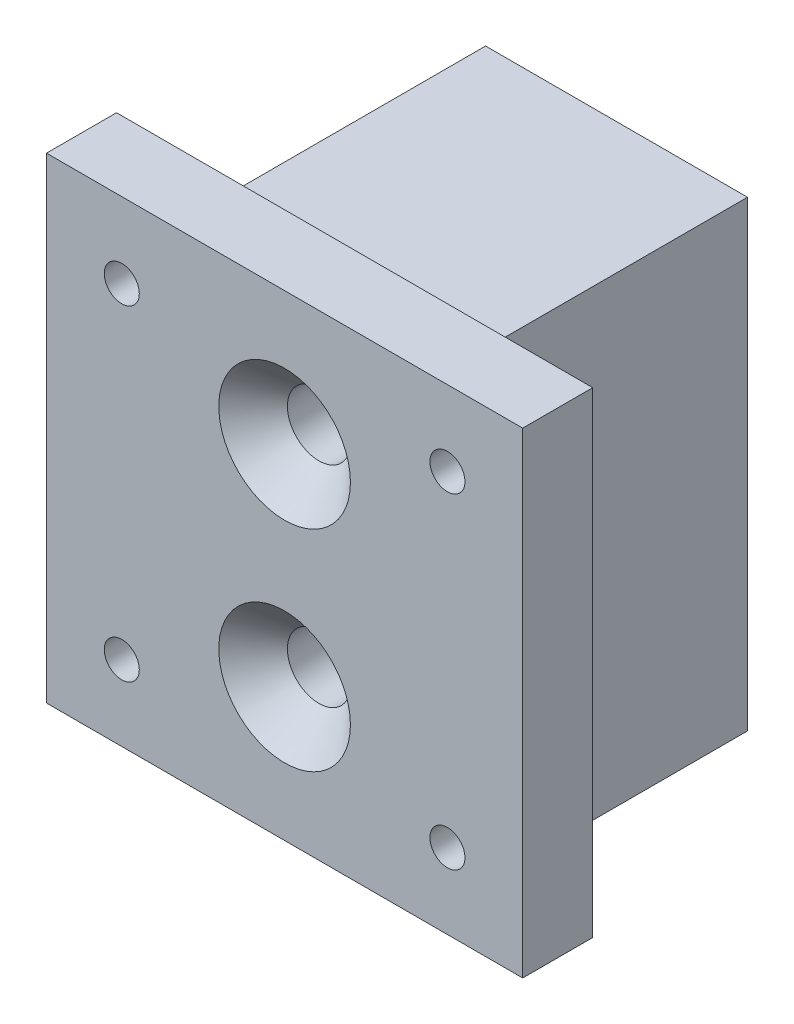
ISO-10303-21;
HEADER;
FILE_DESCRIPTION(('STEP AP214'),'2;1');
FILE_NAME('part.step','',(''),(''),'','','');
FILE_SCHEMA(('AUTOMOTIVE_DESIGN { 1 0 10303 214 1 1 1 1 }'));
ENDSEC;
DATA;
#1=APPLICATION_CONTEXT('core data for automotive mechanical design processes');
#2=APPLICATION_PROTOCOL_DEFINITION('international standard','automotive_design',2000,#1);
#3=PRODUCT_CONTEXT('',#1,'mechanical');
#4=PRODUCT('Part','Part','',(#3));
#5=PRODUCT_RELATED_PRODUCT_CATEGORY('part','',(#4));
#6=PRODUCT_DEFINITION_FORMATION('','',#4);
#7=PRODUCT_DEFINITION_CONTEXT('part definition',#1,'design');
#8=PRODUCT_DEFINITION('design','',#6,#7);
#9=PRODUCT_DEFINITION_SHAPE('','',#8);
#10=(LENGTH_UNIT() NAMED_UNIT(*) SI_UNIT(.MILLI.,.METRE.));
#11=(NAMED_UNIT(*) PLANE_ANGLE_UNIT() SI_UNIT($,.RADIAN.));
#12=(NAMED_UNIT(*) SI_UNIT($,.STERADIAN.) SOLID_ANGLE_UNIT());
#13=UNCERTAINTY_MEASURE_WITH_UNIT(LENGTH_MEASURE(1.E-05),#10,'distance_accuracy_value','');
#14=(GEOMETRIC_REPRESENTATION_CONTEXT(3) GLOBAL_UNCERTAINTY_ASSIGNED_CONTEXT((#13)) GLOBAL_UNIT_ASSIGNED_CONTEXT((#10,
#11,#12)) REPRESENTATION_CONTEXT('',''));
#15=CARTESIAN_POINT('',(0.,0.,0.));
#16=DIRECTION('',(0.,0.,1.));
#17=DIRECTION('',(1.,0.,0.));
#18=AXIS2_PLACEMENT_3D('',#15,#16,#17);
#19=CARTESIAN_POINT('',(18.7,30.,0.));
#20=DIRECTION('',(0.,0.,-1.));
#21=DIRECTION('',(-1.,0.,0.));
#22=AXIS2_PLACEMENT_3D('',#19,#20,#21);
#23=PLANE('',#22);
#24=DIRECTION('',(1.,0.,0.));
#25=VECTOR('',#24,1.);
#26=CARTESIAN_POINT('',(-7.65,0.400000000000005,0.));
#27=LINE('',#26,#25);
#28=CARTESIAN_POINT('',(0.,0.400000000000005,0.));
#29=VERTEX_POINT('',#28);
#30=CARTESIAN_POINT('',(18.7,0.400000000000005,0.));
#31=VERTEX_POINT('',#30);
#32=EDGE_CURVE('E11',#29,#31,#27,.T.);
#33=ORIENTED_EDGE('',*,*,#32,.F.);
#34=DIRECTION('',(0.,-1.,0.));
#35=VECTOR('',#34,1.);
#36=CARTESIAN_POINT('',(0.,30.,0.));
#37=LINE('',#36,#35);
#38=CARTESIAN_POINT('',(0.,0.,0.));
#39=VERTEX_POINT('',#38);
#40=EDGE_CURVE('E222',#29,#39,#37,.T.);
#41=ORIENTED_EDGE('',*,*,#40,.T.);
#42=DIRECTION('',(1.,0.,0.));
#43=VECTOR('',#42,1.);
#44=CARTESIAN_POINT('',(18.7,0.,0.));
#45=LINE('',#44,#43);
#46=CARTESIAN_POINT('',(18.7,0.,0.));
#47=VERTEX_POINT('',#46);
#48=EDGE_CURVE('E216',#39,#47,#45,.T.);
#49=ORIENTED_EDGE('',*,*,#48,.T.);
#50=DIRECTION('',(0.,-1.,0.));
#51=VECTOR('',#50,1.);
#52=CARTESIAN_POINT('',(18.7,30.,0.));
#53=LINE('',#52,#51);
#54=EDGE_CURVE('E219',#31,#47,#53,.T.);
#55=ORIENTED_EDGE('',*,*,#54,.F.);
#56=EDGE_LOOP('',(#33,#41,#49,#55));
#57=FACE_BOUND('',#56,.T.);
#58=ADVANCED_FACE('F36',(#57),#23,.F.);
#59=CARTESIAN_POINT('',(0.,0.,0.));
#60=DIRECTION('',(0.,-1.,0.));
#61=DIRECTION('',(0.,0.,-1.));
#62=AXIS2_PLACEMENT_3D('',#59,#60,#61);
#63=PLANE('',#62);
#64=DIRECTION('',(0.,0.,-1.));
#65=VECTOR('',#64,1.);
#66=CARTESIAN_POINT('',(18.7,0.,-18.7));
#67=LINE('',#66,#65);
#68=CARTESIAN_POINT('',(18.7,0.,-18.7));
#69=VERTEX_POINT('',#68);
#70=EDGE_CURVE('E208',#47,#69,#67,.T.);
#71=ORIENTED_EDGE('',*,*,#70,.F.);
#72=ORIENTED_EDGE('',*,*,#48,.F.);
#73=DIRECTION('',(0.,0.,1.));
#74=VECTOR('',#73,1.);
#75=CARTESIAN_POINT('',(0.,0.,-18.7));
#76=LINE('',#75,#74);
#77=CARTESIAN_POINT('',(0.,0.,-18.7));
#78=VERTEX_POINT('',#77);
#79=EDGE_CURVE('E213',#78,#39,#76,.T.);
#80=ORIENTED_EDGE('',*,*,#79,.F.);
#81=DIRECTION('',(-1.,0.,0.));
#82=VECTOR('',#81,1.);
#83=CARTESIAN_POINT('',(18.7,0.,-18.7));
#84=LINE('',#83,#82);
#85=EDGE_CURVE('E211',#69,#78,#84,.T.);
#86=ORIENTED_EDGE('',*,*,#85,.F.);
#87=EDGE_LOOP('',(#71,#72,#80,#86));
#88=FACE_BOUND('',#87,.T.);
#89=DIRECTION('',(-1.,0.,0.));
#90=VECTOR('',#89,1.);
#91=CARTESIAN_POINT('',(3.,0.,-15.7));
#92=LINE('',#91,#90);
#93=CARTESIAN_POINT('',(15.7,0.,-15.7));
#94=VERTEX_POINT('',#93);
#95=CARTESIAN_POINT('',(3.,0.,-15.7));
#96=VERTEX_POINT('',#95);
#97=EDGE_CURVE('E182',#94,#96,#92,.T.);
#98=ORIENTED_EDGE('',*,*,#97,.T.);
#99=DIRECTION('',(0.,0.,1.));
#100=VECTOR('',#99,1.);
#101=CARTESIAN_POINT('',(3.,0.,-3.));
#102=LINE('',#101,#100);
#103=CARTESIAN_POINT('',(3.,0.,-3.));
#104=VERTEX_POINT('',#103);
#105=EDGE_CURVE('E61',#96,#104,#102,.T.);
#106=ORIENTED_EDGE('',*,*,#105,.T.);
#107=DIRECTION('',(1.,0.,0.));
#108=VECTOR('',#107,1.);
#109=CARTESIAN_POINT('',(3.,0.,-3.));
#110=LINE('',#109,#108);
#111=CARTESIAN_POINT('',(15.7,0.,-3.));
#112=VERTEX_POINT('',#111);
#113=EDGE_CURVE('E193',#104,#112,#110,.T.);
#114=ORIENTED_EDGE('',*,*,#113,.T.);
#115=DIRECTION('',(0.,0.,-1.));
#116=VECTOR('',#115,1.);
#117=CARTESIAN_POINT('',(15.7,0.,-3.));
#118=LINE('',#117,#116);
#119=EDGE_CURVE('E196',#112,#94,#118,.T.);
#120=ORIENTED_EDGE('',*,*,#119,.T.);
#121=EDGE_LOOP('',(#98,#106,#114,#120));
#122=FACE_BOUND('',#121,.T.);
#123=ADVANCED_FACE('F237',(#88,#122),#63,.T.);
#124=CARTESIAN_POINT('',(18.7,30.,-18.7));
#125=DIRECTION('',(-1.,0.,0.));
#126=DIRECTION('',(0.,0.,1.));
#127=AXIS2_PLACEMENT_3D('',#124,#125,#126);
#128=PLANE('',#127);
#129=ORIENTED_EDGE('',*,*,#70,.T.);
#130=DIRECTION('',(0.,-1.,0.));
#131=VECTOR('',#130,1.);
#132=CARTESIAN_POINT('',(18.7,30.,-18.7));
#133=LINE('',#132,#131);
#134=CARTESIAN_POINT('',(18.7,33.,-18.7));
#135=VERTEX_POINT('',#134);
#136=EDGE_CURVE('E45',#135,#69,#133,.T.);
#137=ORIENTED_EDGE('',*,*,#136,.F.);
#138=DIRECTION('',(0.,0.,-1.));
#139=VECTOR('',#138,1.);
#140=CARTESIAN_POINT('',(18.7,33.,-18.7));
#141=LINE('',#140,#139);
#142=CARTESIAN_POINT('',(18.7,33.,0.));
#143=VERTEX_POINT('',#142);
#144=EDGE_CURVE('E172',#143,#135,#141,.T.);
#145=ORIENTED_EDGE('',*,*,#144,.F.);
#146=EDGE_CURVE('E220',#143,#31,#53,.T.);
#147=ORIENTED_EDGE('',*,*,#146,.T.);
#148=ORIENTED_EDGE('',*,*,#54,.T.);
#149=EDGE_LOOP('',(#129,#137,#145,#147,#148));
#150=FACE_BOUND('',#149,.T.);
#151=ADVANCED_FACE('F38',(#150),#128,.F.);
#152=CARTESIAN_POINT('',(18.7,30.,-18.7));
#153=DIRECTION('',(0.,0.,1.));
#154=DIRECTION('',(1.,0.,0.));
#155=AXIS2_PLACEMENT_3D('',#152,#153,#154);
#156=PLANE('',#155);
#157=CARTESIAN_POINT('',(9.35,24.9,-18.7));
#158=DIRECTION('',(0.,0.,1.));
#159=DIRECTION('',(1.,0.,0.));
#160=AXIS2_PLACEMENT_3D('',#157,#158,#159);
#161=CIRCLE('',#160,2.25);
#162=CARTESIAN_POINT('',(11.6,24.9,-18.7));
#163=VERTEX_POINT('',#162);
#164=EDGE_CURVE('E302',#163,#163,#161,.T.);
#165=ORIENTED_EDGE('',*,*,#164,.T.);
#166=EDGE_LOOP('',(#165));
#167=FACE_BOUND('',#166,.T.);
#168=CARTESIAN_POINT('',(9.35,9.9,-18.7));
#169=DIRECTION('',(0.,0.,1.));
#170=DIRECTION('',(1.,0.,0.));
#171=AXIS2_PLACEMENT_3D('',#168,#169,#170);
#172=CIRCLE('',#171,2.25);
#173=CARTESIAN_POINT('',(11.6,9.9,-18.7));
#174=VERTEX_POINT('',#173);
#175=EDGE_CURVE('E271',#174,#174,#172,.T.);
#176=ORIENTED_EDGE('',*,*,#175,.T.);
#177=EDGE_LOOP('',(#176));
#178=FACE_BOUND('',#177,.T.);
#179=ORIENTED_EDGE('',*,*,#85,.T.);
#180=DIRECTION('',(0.,-1.,0.));
#181=VECTOR('',#180,1.);
#182=CARTESIAN_POINT('',(0.,30.,-18.7));
#183=LINE('',#182,#181);
#184=CARTESIAN_POINT('',(0.,33.,-18.7));
#185=VERTEX_POINT('',#184);
#186=EDGE_CURVE('E226',#185,#78,#183,.T.);
#187=ORIENTED_EDGE('',*,*,#186,.F.);
#188=DIRECTION('',(-1.,0.,0.));
#189=VECTOR('',#188,1.);
#190=CARTESIAN_POINT('',(0.,33.,-18.7));
#191=LINE('',#190,#189);
#192=EDGE_CURVE('E175',#135,#185,#191,.T.);
#193=ORIENTED_EDGE('',*,*,#192,.F.);
#194=ORIENTED_EDGE('',*,*,#136,.T.);
#195=EDGE_LOOP('',(#179,#187,#193,#194));
#196=FACE_BOUND('',#195,.T.);
#197=ADVANCED_FACE('F231',(#167,#178,#196),#156,.F.);
#198=CARTESIAN_POINT('',(0.,30.,-18.7));
#199=DIRECTION('',(1.,0.,0.));
#200=DIRECTION('',(0.,0.,-1.));
#201=AXIS2_PLACEMENT_3D('',#198,#199,#200);
#202=PLANE('',#201);
#203=ORIENTED_EDGE('',*,*,#79,.T.);
#204=ORIENTED_EDGE('',*,*,#40,.F.);
#205=CARTESIAN_POINT('',(0.,33.,0.));
#206=VERTEX_POINT('',#205);
#207=EDGE_CURVE('E223',#206,#29,#37,.T.);
#208=ORIENTED_EDGE('',*,*,#207,.F.);
#209=DIRECTION('',(0.,0.,1.));
#210=VECTOR('',#209,1.);
#211=CARTESIAN_POINT('',(0.,33.,-18.7));
#212=LINE('',#211,#210);
#213=EDGE_CURVE('E162',#185,#206,#212,.T.);
#214=ORIENTED_EDGE('',*,*,#213,.F.);
#215=ORIENTED_EDGE('',*,*,#186,.T.);
#216=EDGE_LOOP('',(#203,#204,#208,#214,#215));
#217=FACE_BOUND('',#216,.T.);
#218=ADVANCED_FACE('F241',(#217),#202,.F.);
#219=CARTESIAN_POINT('',(3.,30.,-3.));
#220=DIRECTION('',(1.,0.,0.));
#221=DIRECTION('',(0.,0.,-1.));
#222=AXIS2_PLACEMENT_3D('',#219,#220,#221);
#223=PLANE('',#222);
#224=ORIENTED_EDGE('',*,*,#105,.F.);
#225=DIRECTION('',(0.,-1.,0.));
#226=VECTOR('',#225,1.);
#227=CARTESIAN_POINT('',(3.,30.,-15.7));
#228=LINE('',#227,#226);
#229=CARTESIAN_POINT('',(3.,30.,-15.7));
#230=VERTEX_POINT('',#229);
#231=EDGE_CURVE('E191',#230,#96,#228,.T.);
#232=ORIENTED_EDGE('',*,*,#231,.F.);
#233=DIRECTION('',(0.,0.,1.));
#234=VECTOR('',#233,1.);
#235=CARTESIAN_POINT('',(3.,30.,-3.));
#236=LINE('',#235,#234);
#237=CARTESIAN_POINT('',(3.,30.,-3.));
#238=VERTEX_POINT('',#237);
#239=EDGE_CURVE('E178',#230,#238,#236,.T.);
#240=ORIENTED_EDGE('',*,*,#239,.T.);
#241=DIRECTION('',(0.,-1.,0.));
#242=VECTOR('',#241,1.);
#243=CARTESIAN_POINT('',(3.,30.,-3.));
#244=LINE('',#243,#242);
#245=EDGE_CURVE('E206',#238,#104,#244,.T.);
#246=ORIENTED_EDGE('',*,*,#245,.T.);
#247=EDGE_LOOP('',(#224,#232,#240,#246));
#248=FACE_BOUND('',#247,.T.);
#249=ADVANCED_FACE('F293',(#248),#223,.T.);
#250=CARTESIAN_POINT('',(3.,30.,-3.));
#251=DIRECTION('',(0.,0.,-1.));
#252=DIRECTION('',(-1.,0.,0.));
#253=AXIS2_PLACEMENT_3D('',#250,#251,#252);
#254=PLANE('',#253);
#255=CARTESIAN_POINT('',(9.35,24.9,-3.));
#256=DIRECTION('',(0.,0.,-1.));
#257=DIRECTION('',(-1.,0.,0.));
#258=AXIS2_PLACEMENT_3D('',#255,#256,#257);
#259=CIRCLE('',#258,2.25);
#260=CARTESIAN_POINT('',(7.10000000000001,24.9,-3.));
#261=VERTEX_POINT('',#260);
#262=EDGE_CURVE('E316',#261,#261,#259,.T.);
#263=ORIENTED_EDGE('',*,*,#262,.F.);
#264=EDGE_LOOP('',(#263));
#265=FACE_BOUND('',#264,.T.);
#266=CARTESIAN_POINT('',(9.35,9.9,-3.));
#267=DIRECTION('',(0.,0.,-1.));
#268=DIRECTION('',(-1.,0.,0.));
#269=AXIS2_PLACEMENT_3D('',#266,#267,#268);
#270=CIRCLE('',#269,2.25);
#271=CARTESIAN_POINT('',(7.10000000000001,9.9,-3.));
#272=VERTEX_POINT('',#271);
#273=EDGE_CURVE('E264',#272,#272,#270,.T.);
#274=ORIENTED_EDGE('',*,*,#273,.F.);
#275=EDGE_LOOP('',(#274));
#276=FACE_BOUND('',#275,.T.);
#277=ORIENTED_EDGE('',*,*,#113,.F.);
#278=ORIENTED_EDGE('',*,*,#245,.F.);
#279=DIRECTION('',(1.,0.,0.));
#280=VECTOR('',#279,1.);
#281=CARTESIAN_POINT('',(3.,30.,-3.));
#282=LINE('',#281,#280);
#283=CARTESIAN_POINT('',(15.7,30.,-3.));
#284=VERTEX_POINT('',#283);
#285=EDGE_CURVE('E181',#238,#284,#282,.T.);
#286=ORIENTED_EDGE('',*,*,#285,.T.);
#287=DIRECTION('',(0.,-1.,0.));
#288=VECTOR('',#287,1.);
#289=CARTESIAN_POINT('',(15.7,30.,-3.));
#290=LINE('',#289,#288);
#291=EDGE_CURVE('E204',#284,#112,#290,.T.);
#292=ORIENTED_EDGE('',*,*,#291,.T.);
#293=EDGE_LOOP('',(#277,#278,#286,#292));
#294=FACE_BOUND('',#293,.T.);
#295=ADVANCED_FACE('F542',(#265,#276,#294),#254,.T.);
#296=CARTESIAN_POINT('',(15.7,30.,-3.));
#297=DIRECTION('',(-1.,0.,0.));
#298=DIRECTION('',(0.,0.,1.));
#299=AXIS2_PLACEMENT_3D('',#296,#297,#298);
#300=PLANE('',#299);
#301=ORIENTED_EDGE('',*,*,#119,.F.);
#302=ORIENTED_EDGE('',*,*,#291,.F.);
#303=DIRECTION('',(0.,0.,-1.));
#304=VECTOR('',#303,1.);
#305=CARTESIAN_POINT('',(15.7,30.,-3.));
#306=LINE('',#305,#304);
#307=CARTESIAN_POINT('',(15.7,30.,-15.7));
#308=VERTEX_POINT('',#307);
#309=EDGE_CURVE('E185',#284,#308,#306,.T.);
#310=ORIENTED_EDGE('',*,*,#309,.T.);
#311=DIRECTION('',(0.,-1.,0.));
#312=VECTOR('',#311,1.);
#313=CARTESIAN_POINT('',(15.7,30.,-15.7));
#314=LINE('',#313,#312);
#315=EDGE_CURVE('E202',#308,#94,#314,.T.);
#316=ORIENTED_EDGE('',*,*,#315,.T.);
#317=EDGE_LOOP('',(#301,#302,#310,#316));
#318=FACE_BOUND('',#317,.T.);
#319=ADVANCED_FACE('F535',(#318),#300,.T.);
#320=CARTESIAN_POINT('',(3.,30.,-15.7));
#321=DIRECTION('',(0.,0.,1.));
#322=DIRECTION('',(1.,0.,0.));
#323=AXIS2_PLACEMENT_3D('',#320,#321,#322);
#324=PLANE('',#323);
#325=CARTESIAN_POINT('',(9.35,24.9,-15.7));
#326=DIRECTION('',(0.,0.,1.));
#327=DIRECTION('',(1.,0.,0.));
#328=AXIS2_PLACEMENT_3D('',#325,#326,#327);
#329=CIRCLE('',#328,2.25);
#330=CARTESIAN_POINT('',(11.6,24.9,-15.7));
#331=VERTEX_POINT('',#330);
#332=EDGE_CURVE('E313',#331,#331,#329,.T.);
#333=ORIENTED_EDGE('',*,*,#332,.F.);
#334=EDGE_LOOP('',(#333));
#335=FACE_BOUND('',#334,.T.);
#336=CARTESIAN_POINT('',(9.35,9.9,-15.7));
#337=DIRECTION('',(0.,0.,1.));
#338=DIRECTION('',(1.,0.,0.));
#339=AXIS2_PLACEMENT_3D('',#336,#337,#338);
#340=CIRCLE('',#339,2.25);
#341=CARTESIAN_POINT('',(11.6,9.9,-15.7));
#342=VERTEX_POINT('',#341);
#343=EDGE_CURVE('E266',#342,#342,#340,.T.);
#344=ORIENTED_EDGE('',*,*,#343,.F.);
#345=EDGE_LOOP('',(#344));
#346=FACE_BOUND('',#345,.T.);
#347=ORIENTED_EDGE('',*,*,#97,.F.);
#348=ORIENTED_EDGE('',*,*,#315,.F.);
#349=DIRECTION('',(-1.,0.,0.));
#350=VECTOR('',#349,1.);
#351=CARTESIAN_POINT('',(3.,30.,-15.7));
#352=LINE('',#351,#350);
#353=EDGE_CURVE('E188',#308,#230,#352,.T.);
#354=ORIENTED_EDGE('',*,*,#353,.T.);
#355=ORIENTED_EDGE('',*,*,#231,.T.);
#356=EDGE_LOOP('',(#347,#348,#354,#355));
#357=FACE_BOUND('',#356,.T.);
#358=ADVANCED_FACE('F530',(#335,#346,#357),#324,.T.);
#359=CARTESIAN_POINT('',(0.,30.,0.));
#360=DIRECTION('',(0.,1.,0.));
#361=DIRECTION('',(0.,0.,1.));
#362=AXIS2_PLACEMENT_3D('',#359,#360,#361);
#363=PLANE('',#362);
#364=ORIENTED_EDGE('',*,*,#239,.F.);
#365=ORIENTED_EDGE('',*,*,#353,.F.);
#366=ORIENTED_EDGE('',*,*,#309,.F.);
#367=ORIENTED_EDGE('',*,*,#285,.F.);
#368=EDGE_LOOP('',(#364,#365,#366,#367));
#369=FACE_BOUND('',#368,.T.);
#370=ADVANCED_FACE('F499',(#369),#363,.F.);
#371=CARTESIAN_POINT('',(0.,33.,0.));
#372=DIRECTION('',(0.,1.,0.));
#373=DIRECTION('',(0.,0.,1.));
#374=AXIS2_PLACEMENT_3D('',#371,#372,#373);
#375=PLANE('',#374);
#376=ORIENTED_EDGE('',*,*,#213,.T.);
#377=DIRECTION('',(1.,0.,0.));
#378=VECTOR('',#377,1.);
#379=CARTESIAN_POINT('',(0.,33.,0.));
#380=LINE('',#379,#378);
#381=EDGE_CURVE('E165',#206,#143,#380,.T.);
#382=ORIENTED_EDGE('',*,*,#381,.T.);
#383=ORIENTED_EDGE('',*,*,#144,.T.);
#384=ORIENTED_EDGE('',*,*,#192,.T.);
#385=EDGE_LOOP('',(#376,#382,#383,#384));
#386=FACE_BOUND('',#385,.T.);
#387=ADVANCED_FACE('F244',(#386),#375,.T.);
#388=CARTESIAN_POINT('',(-7.65,34.4,5.));
#389=DIRECTION('',(1.,0.,0.));
#390=DIRECTION('',(0.,1.,0.));
#391=AXIS2_PLACEMENT_3D('',#388,#389,#390);
#392=PLANE('',#391);
#393=DIRECTION('',(0.,-1.,0.));
#394=VECTOR('',#393,1.);
#395=CARTESIAN_POINT('',(-7.65,34.4,0.));
#396=LINE('',#395,#394);
#397=CARTESIAN_POINT('',(-7.65,34.4,0.));
#398=VERTEX_POINT('',#397);
#399=CARTESIAN_POINT('',(-7.65,0.400000000000005,0.));
#400=VERTEX_POINT('',#399);
#401=EDGE_CURVE('E161',#398,#400,#396,.T.);
#402=ORIENTED_EDGE('',*,*,#401,.T.);
#403=DIRECTION('',(0.,0.,-1.));
#404=VECTOR('',#403,1.);
#405=CARTESIAN_POINT('',(-7.65,0.400000000000005,5.));
#406=LINE('',#405,#404);
#407=CARTESIAN_POINT('',(-7.65,0.400000000000005,5.));
#408=VERTEX_POINT('',#407);
#409=EDGE_CURVE('E141',#408,#400,#406,.T.);
#410=ORIENTED_EDGE('',*,*,#409,.F.);
#411=DIRECTION('',(0.,-1.,0.));
#412=VECTOR('',#411,1.);
#413=CARTESIAN_POINT('',(-7.65,34.4,5.));
#414=LINE('',#413,#412);
#415=CARTESIAN_POINT('',(-7.65,34.4,5.));
#416=VERTEX_POINT('',#415);
#417=EDGE_CURVE('E148',#416,#408,#414,.T.);
#418=ORIENTED_EDGE('',*,*,#417,.F.);
#419=DIRECTION('',(0.,0.,-1.));
#420=VECTOR('',#419,1.);
#421=CARTESIAN_POINT('',(-7.65,34.4,5.));
#422=LINE('',#421,#420);
#423=EDGE_CURVE('E258',#416,#398,#422,.T.);
#424=ORIENTED_EDGE('',*,*,#423,.T.);
#425=EDGE_LOOP('',(#402,#410,#418,#424));
#426=FACE_BOUND('',#425,.T.);
#427=ADVANCED_FACE('F159',(#426),#392,.F.);
#428=CARTESIAN_POINT('',(-7.65,0.400000000000005,5.));
#429=DIRECTION('',(0.,1.,0.));
#430=DIRECTION('',(0.,0.,1.));
#431=AXIS2_PLACEMENT_3D('',#428,#429,#430);
#432=PLANE('',#431);
#433=EDGE_CURVE('E47',#400,#29,#27,.T.);
#434=ORIENTED_EDGE('',*,*,#433,.T.);
#435=ORIENTED_EDGE('',*,*,#32,.T.);
#436=CARTESIAN_POINT('',(26.35,0.400000000000005,0.));
#437=VERTEX_POINT('',#436);
#438=EDGE_CURVE('E48',#31,#437,#27,.T.);
#439=ORIENTED_EDGE('',*,*,#438,.T.);
#440=DIRECTION('',(0.,0.,-1.));
#441=VECTOR('',#440,1.);
#442=CARTESIAN_POINT('',(26.35,0.400000000000005,5.));
#443=LINE('',#442,#441);
#444=CARTESIAN_POINT('',(26.35,0.400000000000005,5.));
#445=VERTEX_POINT('',#444);
#446=EDGE_CURVE('E144',#445,#437,#443,.T.);
#447=ORIENTED_EDGE('',*,*,#446,.F.);
#448=DIRECTION('',(1.,0.,0.));
#449=VECTOR('',#448,1.);
#450=CARTESIAN_POINT('',(-7.65,0.400000000000005,5.));
#451=LINE('',#450,#449);
#452=EDGE_CURVE('E136',#408,#445,#451,.T.);
#453=ORIENTED_EDGE('',*,*,#452,.F.);
#454=ORIENTED_EDGE('',*,*,#409,.T.);
#455=EDGE_LOOP('',(#434,#435,#439,#447,#453,#454));
#456=FACE_BOUND('',#455,.T.);
#457=ADVANCED_FACE('F139',(#456),#432,.F.);
#458=CARTESIAN_POINT('',(26.35,34.4,5.));
#459=DIRECTION('',(-1.,0.,0.));
#460=DIRECTION('',(0.,-1.,0.));
#461=AXIS2_PLACEMENT_3D('',#458,#459,#460);
#462=PLANE('',#461);
#463=DIRECTION('',(0.,1.,0.));
#464=VECTOR('',#463,1.);
#465=CARTESIAN_POINT('',(26.35,34.4,0.));
#466=LINE('',#465,#464);
#467=CARTESIAN_POINT('',(26.35,34.4,0.));
#468=VERTEX_POINT('',#467);
#469=EDGE_CURVE('E252',#437,#468,#466,.T.);
#470=ORIENTED_EDGE('',*,*,#469,.T.);
#471=DIRECTION('',(0.,0.,-1.));
#472=VECTOR('',#471,1.);
#473=CARTESIAN_POINT('',(26.35,34.4,5.));
#474=LINE('',#473,#472);
#475=CARTESIAN_POINT('',(26.35,34.4,5.));
#476=VERTEX_POINT('',#475);
#477=EDGE_CURVE('E167',#476,#468,#474,.T.);
#478=ORIENTED_EDGE('',*,*,#477,.F.);
#479=DIRECTION('',(0.,1.,0.));
#480=VECTOR('',#479,1.);
#481=CARTESIAN_POINT('',(26.35,34.4,5.));
#482=LINE('',#481,#480);
#483=EDGE_CURVE('E147',#445,#476,#482,.T.);
#484=ORIENTED_EDGE('',*,*,#483,.F.);
#485=ORIENTED_EDGE('',*,*,#446,.T.);
#486=EDGE_LOOP('',(#470,#478,#484,#485));
#487=FACE_BOUND('',#486,.T.);
#488=ADVANCED_FACE('F275',(#487),#462,.F.);
#489=CARTESIAN_POINT('',(-7.65,34.4,5.));
#490=DIRECTION('',(0.,-1.,0.));
#491=DIRECTION('',(0.,0.,-1.));
#492=AXIS2_PLACEMENT_3D('',#489,#490,#491);
#493=PLANE('',#492);
#494=DIRECTION('',(-1.,0.,0.));
#495=VECTOR('',#494,1.);
#496=CARTESIAN_POINT('',(-7.65,34.4,0.));
#497=LINE('',#496,#495);
#498=EDGE_CURVE('E157',#468,#398,#497,.T.);
#499=ORIENTED_EDGE('',*,*,#498,.T.);
#500=ORIENTED_EDGE('',*,*,#423,.F.);
#501=DIRECTION('',(-1.,0.,0.));
#502=VECTOR('',#501,1.);
#503=CARTESIAN_POINT('',(-7.65,34.4,5.));
#504=LINE('',#503,#502);
#505=EDGE_CURVE('E153',#476,#416,#504,.T.);
#506=ORIENTED_EDGE('',*,*,#505,.F.);
#507=ORIENTED_EDGE('',*,*,#477,.T.);
#508=EDGE_LOOP('',(#499,#500,#506,#507));
#509=FACE_BOUND('',#508,.T.);
#510=ADVANCED_FACE('F262',(#509),#493,.F.);
#511=CARTESIAN_POINT('',(0.,0.,5.));
#512=DIRECTION('',(0.,0.,1.));
#513=DIRECTION('',(1.,0.,0.));
#514=AXIS2_PLACEMENT_3D('',#511,#512,#513);
#515=PLANE('',#514);
#516=CARTESIAN_POINT('',(-2.275,29.025,5.));
#517=DIRECTION('',(0.,0.,1.));
#518=DIRECTION('',(1.,0.,0.));
#519=AXIS2_PLACEMENT_3D('',#516,#517,#518);
#520=CIRCLE('',#519,1.25);
#521=CARTESIAN_POINT('',(-1.025,29.025,5.));
#522=VERTEX_POINT('',#521);
#523=EDGE_CURVE('E344',#522,#522,#520,.T.);
#524=ORIENTED_EDGE('',*,*,#523,.F.);
#525=EDGE_LOOP('',(#524));
#526=FACE_BOUND('',#525,.T.);
#527=CARTESIAN_POINT('',(20.975,29.025,5.));
#528=DIRECTION('',(0.,0.,1.));
#529=DIRECTION('',(1.,0.,0.));
#530=AXIS2_PLACEMENT_3D('',#527,#528,#529);
#531=CIRCLE('',#530,1.25);
#532=CARTESIAN_POINT('',(22.225,29.025,5.));
#533=VERTEX_POINT('',#532);
#534=EDGE_CURVE('E341',#533,#533,#531,.T.);
#535=ORIENTED_EDGE('',*,*,#534,.F.);
#536=EDGE_LOOP('',(#535));
#537=FACE_BOUND('',#536,.T.);
#538=CARTESIAN_POINT('',(-2.275,5.775,5.));
#539=DIRECTION('',(0.,0.,1.));
#540=DIRECTION('',(1.,0.,0.));
#541=AXIS2_PLACEMENT_3D('',#538,#539,#540);
#542=CIRCLE('',#541,1.25);
#543=CARTESIAN_POINT('',(-1.025,5.775,5.));
#544=VERTEX_POINT('',#543);
#545=EDGE_CURVE('E335',#544,#544,#542,.T.);
#546=ORIENTED_EDGE('',*,*,#545,.F.);
#547=EDGE_LOOP('',(#546));
#548=FACE_BOUND('',#547,.T.);
#549=CARTESIAN_POINT('',(20.975,5.775,5.));
#550=DIRECTION('',(0.,0.,1.));
#551=DIRECTION('',(1.,0.,0.));
#552=AXIS2_PLACEMENT_3D('',#549,#550,#551);
#553=CIRCLE('',#552,1.25);
#554=CARTESIAN_POINT('',(22.225,5.775,5.));
#555=VERTEX_POINT('',#554);
#556=EDGE_CURVE('E329',#555,#555,#553,.T.);
#557=ORIENTED_EDGE('',*,*,#556,.F.);
#558=EDGE_LOOP('',(#557));
#559=FACE_BOUND('',#558,.T.);
#560=CARTESIAN_POINT('',(9.35,24.9,5.));
#561=DIRECTION('',(0.,0.,1.));
#562=DIRECTION('',(1.,0.,0.));
#563=AXIS2_PLACEMENT_3D('',#560,#561,#562);
#564=CIRCLE('',#563,4.7);
#565=CARTESIAN_POINT('',(14.05,24.9,5.));
#566=VERTEX_POINT('',#565);
#567=EDGE_CURVE('E323',#566,#566,#564,.T.);
#568=ORIENTED_EDGE('',*,*,#567,.F.);
#569=EDGE_LOOP('',(#568));
#570=FACE_BOUND('',#569,.T.);
#571=CARTESIAN_POINT('',(9.35,9.9,5.));
#572=DIRECTION('',(0.,0.,1.));
#573=DIRECTION('',(1.,0.,0.));
#574=AXIS2_PLACEMENT_3D('',#571,#572,#573);
#575=CIRCLE('',#574,4.7);
#576=CARTESIAN_POINT('',(14.05,9.9,5.));
#577=VERTEX_POINT('',#576);
#578=EDGE_CURVE('E308',#577,#577,#575,.T.);
#579=ORIENTED_EDGE('',*,*,#578,.F.);
#580=EDGE_LOOP('',(#579));
#581=FACE_BOUND('',#580,.T.);
#582=ORIENTED_EDGE('',*,*,#417,.T.);
#583=ORIENTED_EDGE('',*,*,#452,.T.);
#584=ORIENTED_EDGE('',*,*,#483,.T.);
#585=ORIENTED_EDGE('',*,*,#505,.T.);
#586=EDGE_LOOP('',(#582,#583,#584,#585));
#587=FACE_BOUND('',#586,.T.);
#588=ADVANCED_FACE('F151',(#526,#537,#548,#559,#570,#581,#587),#515,.T.);
#589=CARTESIAN_POINT('',(0.,0.,0.));
#590=DIRECTION('',(0.,0.,1.));
#591=DIRECTION('',(1.,0.,0.));
#592=AXIS2_PLACEMENT_3D('',#589,#590,#591);
#593=PLANE('',#592);
#594=CARTESIAN_POINT('',(-2.275,29.025,0.));
#595=DIRECTION('',(0.,0.,1.));
#596=DIRECTION('',(1.,0.,0.));
#597=AXIS2_PLACEMENT_3D('',#594,#595,#596);
#598=CIRCLE('',#597,1.25);
#599=CARTESIAN_POINT('',(-1.025,29.025,0.));
#600=VERTEX_POINT('',#599);
#601=EDGE_CURVE('E40',#600,#600,#598,.T.);
#602=ORIENTED_EDGE('',*,*,#601,.T.);
#603=EDGE_LOOP('',(#602));
#604=FACE_BOUND('',#603,.T.);
#605=CARTESIAN_POINT('',(20.975,29.025,0.));
#606=DIRECTION('',(0.,0.,1.));
#607=DIRECTION('',(1.,0.,0.));
#608=AXIS2_PLACEMENT_3D('',#605,#606,#607);
#609=CIRCLE('',#608,1.25);
#610=CARTESIAN_POINT('',(22.225,29.025,0.));
#611=VERTEX_POINT('',#610);
#612=EDGE_CURVE('E338',#611,#611,#609,.T.);
#613=ORIENTED_EDGE('',*,*,#612,.T.);
#614=EDGE_LOOP('',(#613));
#615=FACE_BOUND('',#614,.T.);
#616=CARTESIAN_POINT('',(-2.275,5.775,0.));
#617=DIRECTION('',(0.,0.,1.));
#618=DIRECTION('',(1.,0.,0.));
#619=AXIS2_PLACEMENT_3D('',#616,#617,#618);
#620=CIRCLE('',#619,1.25);
#621=CARTESIAN_POINT('',(-1.025,5.775,0.));
#622=VERTEX_POINT('',#621);
#623=EDGE_CURVE('E332',#622,#622,#620,.T.);
#624=ORIENTED_EDGE('',*,*,#623,.T.);
#625=EDGE_LOOP('',(#624));
#626=FACE_BOUND('',#625,.T.);
#627=CARTESIAN_POINT('',(20.975,5.775,0.));
#628=DIRECTION('',(0.,0.,1.));
#629=DIRECTION('',(1.,0.,0.));
#630=AXIS2_PLACEMENT_3D('',#627,#628,#629);
#631=CIRCLE('',#630,1.25);
#632=CARTESIAN_POINT('',(22.225,5.775,0.));
#633=VERTEX_POINT('',#632);
#634=EDGE_CURVE('E326',#633,#633,#631,.T.);
#635=ORIENTED_EDGE('',*,*,#634,.T.);
#636=EDGE_LOOP('',(#635));
#637=FACE_BOUND('',#636,.T.);
#638=ORIENTED_EDGE('',*,*,#146,.F.);
#639=ORIENTED_EDGE('',*,*,#381,.F.);
#640=ORIENTED_EDGE('',*,*,#207,.T.);
#641=ORIENTED_EDGE('',*,*,#433,.F.);
#642=ORIENTED_EDGE('',*,*,#401,.F.);
#643=ORIENTED_EDGE('',*,*,#498,.F.);
#644=ORIENTED_EDGE('',*,*,#469,.F.);
#645=ORIENTED_EDGE('',*,*,#438,.F.);
#646=EDGE_LOOP('',(#638,#639,#640,#641,#642,#643,#644,#645));
#647=FACE_BOUND('',#646,.T.);
#648=ADVANCED_FACE('F249',(#604,#615,#626,#637,#647),#593,.F.);
#649=CARTESIAN_POINT('',(9.35,9.9,5.));
#650=DIRECTION('',(0.,0.,1.));
#651=DIRECTION('',(1.,0.,0.));
#652=AXIS2_PLACEMENT_3D('',#649,#650,#651);
#653=CONICAL_SURFACE('',#652,4.7,0.785398163397448);
#654=CARTESIAN_POINT('',(9.35,9.9,2.55));
#655=DIRECTION('',(0.,0.,1.));
#656=DIRECTION('',(1.,0.,0.));
#657=AXIS2_PLACEMENT_3D('',#654,#655,#656);
#658=CIRCLE('',#657,2.25);
#659=CARTESIAN_POINT('',(11.6,9.9,2.55));
#660=VERTEX_POINT('',#659);
#661=EDGE_CURVE('E306',#660,#660,#658,.T.);
#662=ORIENTED_EDGE('',*,*,#661,.F.);
#663=EDGE_LOOP('',(#662));
#664=FACE_BOUND('',#663,.T.);
#665=ORIENTED_EDGE('',*,*,#578,.T.);
#666=EDGE_LOOP('',(#665));
#667=FACE_BOUND('',#666,.T.);
#668=ADVANCED_FACE('F381',(#664,#667),#653,.F.);
#669=CARTESIAN_POINT('',(9.35,9.9,5.));
#670=DIRECTION('',(0.,0.,1.));
#671=DIRECTION('',(1.,0.,0.));
#672=AXIS2_PLACEMENT_3D('',#669,#670,#671);
#673=CYLINDRICAL_SURFACE('',#672,2.25);
#674=ORIENTED_EDGE('',*,*,#273,.T.);
#675=EDGE_LOOP('',(#674));
#676=FACE_BOUND('',#675,.T.);
#677=ORIENTED_EDGE('',*,*,#661,.T.);
#678=EDGE_LOOP('',(#677));
#679=FACE_BOUND('',#678,.T.);
#680=ADVANCED_FACE('F384',(#676,#679),#673,.F.);
#681=ORIENTED_EDGE('',*,*,#343,.T.);
#682=EDGE_LOOP('',(#681));
#683=FACE_BOUND('',#682,.T.);
#684=ORIENTED_EDGE('',*,*,#175,.F.);
#685=EDGE_LOOP('',(#684));
#686=FACE_BOUND('',#685,.T.);
#687=ADVANCED_FACE('F376',(#683,#686),#673,.F.);
#688=CARTESIAN_POINT('',(9.35,24.9,5.));
#689=DIRECTION('',(0.,0.,1.));
#690=DIRECTION('',(1.,0.,0.));
#691=AXIS2_PLACEMENT_3D('',#688,#689,#690);
#692=CONICAL_SURFACE('',#691,4.7,0.785398163397448);
#693=CARTESIAN_POINT('',(9.35,24.9,2.55));
#694=DIRECTION('',(0.,0.,1.));
#695=DIRECTION('',(1.,0.,0.));
#696=AXIS2_PLACEMENT_3D('',#693,#694,#695);
#697=CIRCLE('',#696,2.25);
#698=CARTESIAN_POINT('',(11.6,24.9,2.55));
#699=VERTEX_POINT('',#698);
#700=EDGE_CURVE('E320',#699,#699,#697,.T.);
#701=ORIENTED_EDGE('',*,*,#700,.F.);
#702=EDGE_LOOP('',(#701));
#703=FACE_BOUND('',#702,.T.);
#704=ORIENTED_EDGE('',*,*,#567,.T.);
#705=EDGE_LOOP('',(#704));
#706=FACE_BOUND('',#705,.T.);
#707=ADVANCED_FACE('F372',(#703,#706),#692,.F.);
#708=CARTESIAN_POINT('',(9.35,24.9,5.));
#709=DIRECTION('',(0.,0.,1.));
#710=DIRECTION('',(1.,0.,0.));
#711=AXIS2_PLACEMENT_3D('',#708,#709,#710);
#712=CYLINDRICAL_SURFACE('',#711,2.25);
#713=ORIENTED_EDGE('',*,*,#262,.T.);
#714=EDGE_LOOP('',(#713));
#715=FACE_BOUND('',#714,.T.);
#716=ORIENTED_EDGE('',*,*,#700,.T.);
#717=EDGE_LOOP('',(#716));
#718=FACE_BOUND('',#717,.T.);
#719=ADVANCED_FACE('F375',(#715,#718),#712,.F.);
#720=ORIENTED_EDGE('',*,*,#332,.T.);
#721=EDGE_LOOP('',(#720));
#722=FACE_BOUND('',#721,.T.);
#723=ORIENTED_EDGE('',*,*,#164,.F.);
#724=EDGE_LOOP('',(#723));
#725=FACE_BOUND('',#724,.T.);
#726=ADVANCED_FACE('F370',(#722,#725),#712,.F.);
#727=CARTESIAN_POINT('',(20.975,5.775,5.));
#728=DIRECTION('',(0.,0.,1.));
#729=DIRECTION('',(1.,0.,0.));
#730=AXIS2_PLACEMENT_3D('',#727,#728,#729);
#731=CYLINDRICAL_SURFACE('',#730,1.25);
#732=ORIENTED_EDGE('',*,*,#556,.T.);
#733=EDGE_LOOP('',(#732));
#734=FACE_BOUND('',#733,.T.);
#735=ORIENTED_EDGE('',*,*,#634,.F.);
#736=EDGE_LOOP('',(#735));
#737=FACE_BOUND('',#736,.T.);
#738=ADVANCED_FACE('F366',(#734,#737),#731,.F.);
#739=CARTESIAN_POINT('',(-2.275,5.775,5.));
#740=DIRECTION('',(0.,0.,1.));
#741=DIRECTION('',(1.,0.,0.));
#742=AXIS2_PLACEMENT_3D('',#739,#740,#741);
#743=CYLINDRICAL_SURFACE('',#742,1.25);
#744=ORIENTED_EDGE('',*,*,#545,.T.);
#745=EDGE_LOOP('',(#744));
#746=FACE_BOUND('',#745,.T.);
#747=ORIENTED_EDGE('',*,*,#623,.F.);
#748=EDGE_LOOP('',(#747));
#749=FACE_BOUND('',#748,.T.);
#750=ADVANCED_FACE('F360',(#746,#749),#743,.F.);
#751=CARTESIAN_POINT('',(20.975,29.025,5.));
#752=DIRECTION('',(0.,0.,1.));
#753=DIRECTION('',(1.,0.,0.));
#754=AXIS2_PLACEMENT_3D('',#751,#752,#753);
#755=CYLINDRICAL_SURFACE('',#754,1.25);
#756=ORIENTED_EDGE('',*,*,#534,.T.);
#757=EDGE_LOOP('',(#756));
#758=FACE_BOUND('',#757,.T.);
#759=ORIENTED_EDGE('',*,*,#612,.F.);
#760=EDGE_LOOP('',(#759));
#761=FACE_BOUND('',#760,.T.);
#762=ADVANCED_FACE('F355',(#758,#761),#755,.F.);
#763=CARTESIAN_POINT('',(-2.275,29.025,5.));
#764=DIRECTION('',(0.,0.,1.));
#765=DIRECTION('',(1.,0.,0.));
#766=AXIS2_PLACEMENT_3D('',#763,#764,#765);
#767=CYLINDRICAL_SURFACE('',#766,1.25);
#768=ORIENTED_EDGE('',*,*,#523,.T.);
#769=EDGE_LOOP('',(#768));
#770=FACE_BOUND('',#769,.T.);
#771=ORIENTED_EDGE('',*,*,#601,.F.);
#772=EDGE_LOOP('',(#771));
#773=FACE_BOUND('',#772,.T.);
#774=ADVANCED_FACE('F353',(#770,#773),#767,.F.);
#775=CLOSED_SHELL('',(#58,#123,#151,#197,#218,#249,#295,#319,#358,#370,#387,#427,#457,#488,#510,
#588,#648,#668,#680,#687,#707,#719,#726,#738,#750,#762,#774));
#776=MANIFOLD_SOLID_BREP('B2',#775);
#777=ADVANCED_BREP_SHAPE_REPRESENTATION('',(#18,#776),#14);
#778=SHAPE_DEFINITION_REPRESENTATION(#9,#777);
ENDSEC;
END-ISO-10303-21;
